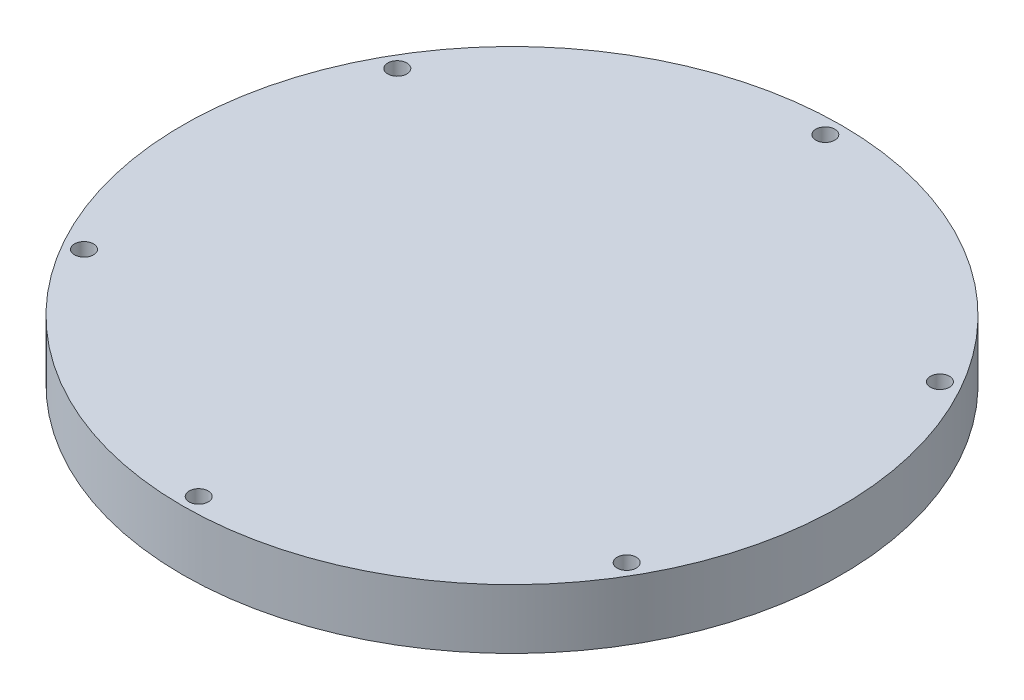
ISO-10303-21;
HEADER;
FILE_DESCRIPTION(('STEP AP214'),'2;1');
FILE_NAME('part.step','',(''),(''),'','','');
FILE_SCHEMA(('AUTOMOTIVE_DESIGN { 1 0 10303 214 1 1 1 1 }'));
ENDSEC;
DATA;
#1=APPLICATION_CONTEXT('core data for automotive mechanical design processes');
#2=APPLICATION_PROTOCOL_DEFINITION('international standard','automotive_design',2000,#1);
#3=PRODUCT_CONTEXT('',#1,'mechanical');
#4=PRODUCT('Part','Part','',(#3));
#5=PRODUCT_RELATED_PRODUCT_CATEGORY('part','',(#4));
#6=PRODUCT_DEFINITION_FORMATION('','',#4);
#7=PRODUCT_DEFINITION_CONTEXT('part definition',#1,'design');
#8=PRODUCT_DEFINITION('design','',#6,#7);
#9=PRODUCT_DEFINITION_SHAPE('','',#8);
#10=(LENGTH_UNIT() NAMED_UNIT(*) SI_UNIT(.MILLI.,.METRE.));
#11=(NAMED_UNIT(*) PLANE_ANGLE_UNIT() SI_UNIT($,.RADIAN.));
#12=(NAMED_UNIT(*) SI_UNIT($,.STERADIAN.) SOLID_ANGLE_UNIT());
#13=UNCERTAINTY_MEASURE_WITH_UNIT(LENGTH_MEASURE(1.E-05),#10,'distance_accuracy_value','');
#14=(GEOMETRIC_REPRESENTATION_CONTEXT(3) GLOBAL_UNCERTAINTY_ASSIGNED_CONTEXT((#13)) GLOBAL_UNIT_ASSIGNED_CONTEXT((#10,
#11,#12)) REPRESENTATION_CONTEXT('',''));
#15=CARTESIAN_POINT('',(0.,0.,0.));
#16=DIRECTION('',(0.,0.,1.));
#17=DIRECTION('',(1.,0.,0.));
#18=AXIS2_PLACEMENT_3D('',#15,#16,#17);
#19=CARTESIAN_POINT('',(0.,10.,0.));
#20=DIRECTION('',(0.,-1.,0.));
#21=DIRECTION('',(0.,0.,-1.));
#22=AXIS2_PLACEMENT_3D('',#19,#20,#21);
#23=CYLINDRICAL_SURFACE('',#22,55.25);
#24=CARTESIAN_POINT('',(0.,10.,0.));
#25=DIRECTION('',(0.,1.,0.));
#26=DIRECTION('',(0.,0.,1.));
#27=AXIS2_PLACEMENT_3D('',#24,#25,#26);
#28=CIRCLE('',#27,55.25);
#29=CARTESIAN_POINT('',(0.,10.,55.25));
#30=VERTEX_POINT('',#29);
#31=EDGE_CURVE('E10',#30,#30,#28,.T.);
#32=ORIENTED_EDGE('',*,*,#31,.F.);
#33=EDGE_LOOP('',(#32));
#34=FACE_BOUND('',#33,.T.);
#35=CARTESIAN_POINT('',(0.,0.,0.));
#36=DIRECTION('',(0.,1.,0.));
#37=DIRECTION('',(0.,0.,1.));
#38=AXIS2_PLACEMENT_3D('',#35,#36,#37);
#39=CIRCLE('',#38,55.25);
#40=CARTESIAN_POINT('',(0.,0.,55.25));
#41=VERTEX_POINT('',#40);
#42=EDGE_CURVE('E34',#41,#41,#39,.T.);
#43=ORIENTED_EDGE('',*,*,#42,.T.);
#44=EDGE_LOOP('',(#43));
#45=FACE_BOUND('',#44,.T.);
#46=ADVANCED_FACE('F31',(#34,#45),#23,.T.);
#47=CARTESIAN_POINT('',(0.,10.,0.));
#48=DIRECTION('',(0.,1.,0.));
#49=DIRECTION('',(0.,0.,1.));
#50=AXIS2_PLACEMENT_3D('',#47,#48,#49);
#51=PLANE('',#50);
#52=CARTESIAN_POINT('',(0.,10.,-52.525));
#53=DIRECTION('',(0.,1.,0.));
#54=DIRECTION('',(0.,0.,1.));
#55=AXIS2_PLACEMENT_3D('',#52,#53,#54);
#56=CIRCLE('',#55,1.59999999999999);
#57=CARTESIAN_POINT('',(0.,10.,-50.925));
#58=VERTEX_POINT('',#57);
#59=EDGE_CURVE('E75',#58,#58,#56,.T.);
#60=ORIENTED_EDGE('',*,*,#59,.F.);
#61=EDGE_LOOP('',(#60));
#62=FACE_BOUND('',#61,.T.);
#63=CARTESIAN_POINT('',(-45.4879843337758,10.,-26.2624999999967));
#64=DIRECTION('',(0.,1.,0.));
#65=DIRECTION('',(0.,0.,1.));
#66=AXIS2_PLACEMENT_3D('',#63,#64,#65);
#67=CIRCLE('',#66,1.59999999999999);
#68=CARTESIAN_POINT('',(-45.4879843337758,10.,-24.6624999999967));
#69=VERTEX_POINT('',#68);
#70=EDGE_CURVE('E69',#69,#69,#67,.T.);
#71=ORIENTED_EDGE('',*,*,#70,.F.);
#72=EDGE_LOOP('',(#71));
#73=FACE_BOUND('',#72,.T.);
#74=CARTESIAN_POINT('',(-45.487984333772,10.,26.2625000000032));
#75=DIRECTION('',(0.,1.,0.));
#76=DIRECTION('',(0.,0.,1.));
#77=AXIS2_PLACEMENT_3D('',#74,#75,#76);
#78=CIRCLE('',#77,1.59999999999999);
#79=CARTESIAN_POINT('',(-45.487984333772,10.,27.8625000000032));
#80=VERTEX_POINT('',#79);
#81=EDGE_CURVE('E63',#80,#80,#78,.T.);
#82=ORIENTED_EDGE('',*,*,#81,.F.);
#83=EDGE_LOOP('',(#82));
#84=FACE_BOUND('',#83,.T.);
#85=CARTESIAN_POINT('',(7.45138652453481E-12,10.,52.525));
#86=DIRECTION('',(0.,1.,0.));
#87=DIRECTION('',(0.,0.,1.));
#88=AXIS2_PLACEMENT_3D('',#85,#86,#87);
#89=CIRCLE('',#88,1.59999999999999);
#90=CARTESIAN_POINT('',(7.45138652453481E-12,10.,54.125));
#91=VERTEX_POINT('',#90);
#92=EDGE_CURVE('E57',#91,#91,#89,.T.);
#93=ORIENTED_EDGE('',*,*,#92,.F.);
#94=EDGE_LOOP('',(#93));
#95=FACE_BOUND('',#94,.T.);
#96=CARTESIAN_POINT('',(45.4879843337832,10.,26.2624999999968));
#97=DIRECTION('',(0.,1.,0.));
#98=DIRECTION('',(0.,0.,1.));
#99=AXIS2_PLACEMENT_3D('',#96,#97,#98);
#100=CIRCLE('',#99,1.59999999999999);
#101=CARTESIAN_POINT('',(45.4879843337832,10.,27.8624999999968));
#102=VERTEX_POINT('',#101);
#103=EDGE_CURVE('E51',#102,#102,#100,.T.);
#104=ORIENTED_EDGE('',*,*,#103,.F.);
#105=EDGE_LOOP('',(#104));
#106=FACE_BOUND('',#105,.T.);
#107=CARTESIAN_POINT('',(45.4879843337795,10.,-26.2625000000032));
#108=DIRECTION('',(0.,1.,0.));
#109=DIRECTION('',(0.,0.,1.));
#110=AXIS2_PLACEMENT_3D('',#107,#108,#109);
#111=CIRCLE('',#110,1.59999999999999);
#112=CARTESIAN_POINT('',(45.4879843337795,10.,-24.6625000000032));
#113=VERTEX_POINT('',#112);
#114=EDGE_CURVE('E45',#113,#113,#111,.T.);
#115=ORIENTED_EDGE('',*,*,#114,.F.);
#116=EDGE_LOOP('',(#115));
#117=FACE_BOUND('',#116,.T.);
#118=ORIENTED_EDGE('',*,*,#31,.T.);
#119=EDGE_LOOP('',(#118));
#120=FACE_BOUND('',#119,.T.);
#121=ADVANCED_FACE('F81',(#62,#73,#84,#95,#106,#117,#120),#51,.T.);
#122=CARTESIAN_POINT('',(0.,0.,0.));
#123=DIRECTION('',(0.,1.,0.));
#124=DIRECTION('',(0.,0.,1.));
#125=AXIS2_PLACEMENT_3D('',#122,#123,#124);
#126=PLANE('',#125);
#127=CARTESIAN_POINT('',(0.,0.,-52.525));
#128=DIRECTION('',(0.,1.,0.));
#129=DIRECTION('',(0.,0.,1.));
#130=AXIS2_PLACEMENT_3D('',#127,#128,#129);
#131=CIRCLE('',#130,1.6);
#132=CARTESIAN_POINT('',(0.,0.,-50.925));
#133=VERTEX_POINT('',#132);
#134=EDGE_CURVE('E72',#133,#133,#131,.T.);
#135=ORIENTED_EDGE('',*,*,#134,.T.);
#136=EDGE_LOOP('',(#135));
#137=FACE_BOUND('',#136,.T.);
#138=CARTESIAN_POINT('',(-45.4879843337758,0.,-26.2624999999967));
#139=DIRECTION('',(0.,1.,0.));
#140=DIRECTION('',(0.,0.,1.));
#141=AXIS2_PLACEMENT_3D('',#138,#139,#140);
#142=CIRCLE('',#141,1.6);
#143=CARTESIAN_POINT('',(-45.4879843337758,0.,-24.6624999999967));
#144=VERTEX_POINT('',#143);
#145=EDGE_CURVE('E66',#144,#144,#142,.T.);
#146=ORIENTED_EDGE('',*,*,#145,.T.);
#147=EDGE_LOOP('',(#146));
#148=FACE_BOUND('',#147,.T.);
#149=CARTESIAN_POINT('',(-45.487984333772,0.,26.2625000000032));
#150=DIRECTION('',(0.,1.,0.));
#151=DIRECTION('',(0.,0.,1.));
#152=AXIS2_PLACEMENT_3D('',#149,#150,#151);
#153=CIRCLE('',#152,1.6);
#154=CARTESIAN_POINT('',(-45.487984333772,0.,27.8625000000032));
#155=VERTEX_POINT('',#154);
#156=EDGE_CURVE('E60',#155,#155,#153,.T.);
#157=ORIENTED_EDGE('',*,*,#156,.T.);
#158=EDGE_LOOP('',(#157));
#159=FACE_BOUND('',#158,.T.);
#160=CARTESIAN_POINT('',(7.45138652453481E-12,0.,52.525));
#161=DIRECTION('',(0.,1.,0.));
#162=DIRECTION('',(0.,0.,1.));
#163=AXIS2_PLACEMENT_3D('',#160,#161,#162);
#164=CIRCLE('',#163,1.6);
#165=CARTESIAN_POINT('',(7.45138652453481E-12,0.,54.125));
#166=VERTEX_POINT('',#165);
#167=EDGE_CURVE('E54',#166,#166,#164,.T.);
#168=ORIENTED_EDGE('',*,*,#167,.T.);
#169=EDGE_LOOP('',(#168));
#170=FACE_BOUND('',#169,.T.);
#171=CARTESIAN_POINT('',(45.4879843337832,0.,26.2624999999968));
#172=DIRECTION('',(0.,1.,0.));
#173=DIRECTION('',(0.,0.,1.));
#174=AXIS2_PLACEMENT_3D('',#171,#172,#173);
#175=CIRCLE('',#174,1.6);
#176=CARTESIAN_POINT('',(45.4879843337832,0.,27.8624999999968));
#177=VERTEX_POINT('',#176);
#178=EDGE_CURVE('E48',#177,#177,#175,.T.);
#179=ORIENTED_EDGE('',*,*,#178,.T.);
#180=EDGE_LOOP('',(#179));
#181=FACE_BOUND('',#180,.T.);
#182=CARTESIAN_POINT('',(45.4879843337795,0.,-26.2625000000032));
#183=DIRECTION('',(0.,1.,0.));
#184=DIRECTION('',(0.,0.,1.));
#185=AXIS2_PLACEMENT_3D('',#182,#183,#184);
#186=CIRCLE('',#185,1.6);
#187=CARTESIAN_POINT('',(45.4879843337795,0.,-24.6625000000032));
#188=VERTEX_POINT('',#187);
#189=EDGE_CURVE('E41',#188,#188,#186,.T.);
#190=ORIENTED_EDGE('',*,*,#189,.T.);
#191=EDGE_LOOP('',(#190));
#192=FACE_BOUND('',#191,.T.);
#193=ORIENTED_EDGE('',*,*,#42,.F.);
#194=EDGE_LOOP('',(#193));
#195=FACE_BOUND('',#194,.T.);
#196=ADVANCED_FACE('F84',(#137,#148,#159,#170,#181,#192,#195),#126,.F.);
#197=CARTESIAN_POINT('',(45.4879843337795,10.,-26.2625000000032));
#198=DIRECTION('',(0.,1.,0.));
#199=DIRECTION('',(0.,0.,1.));
#200=AXIS2_PLACEMENT_3D('',#197,#198,#199);
#201=CYLINDRICAL_SURFACE('',#200,1.59999999999999);
#202=ORIENTED_EDGE('',*,*,#189,.F.);
#203=EDGE_LOOP('',(#202));
#204=FACE_BOUND('',#203,.T.);
#205=ORIENTED_EDGE('',*,*,#114,.T.);
#206=EDGE_LOOP('',(#205));
#207=FACE_BOUND('',#206,.T.);
#208=ADVANCED_FACE('F96',(#204,#207),#201,.F.);
#209=CARTESIAN_POINT('',(45.4879843337832,10.,26.2624999999968));
#210=DIRECTION('',(0.,1.,0.));
#211=DIRECTION('',(0.,0.,1.));
#212=AXIS2_PLACEMENT_3D('',#209,#210,#211);
#213=CYLINDRICAL_SURFACE('',#212,1.59999999999999);
#214=ORIENTED_EDGE('',*,*,#178,.F.);
#215=EDGE_LOOP('',(#214));
#216=FACE_BOUND('',#215,.T.);
#217=ORIENTED_EDGE('',*,*,#103,.T.);
#218=EDGE_LOOP('',(#217));
#219=FACE_BOUND('',#218,.T.);
#220=ADVANCED_FACE('F98',(#216,#219),#213,.F.);
#221=CARTESIAN_POINT('',(7.45138652453481E-12,10.,52.525));
#222=DIRECTION('',(0.,1.,0.));
#223=DIRECTION('',(0.,0.,1.));
#224=AXIS2_PLACEMENT_3D('',#221,#222,#223);
#225=CYLINDRICAL_SURFACE('',#224,1.59999999999999);
#226=ORIENTED_EDGE('',*,*,#167,.F.);
#227=EDGE_LOOP('',(#226));
#228=FACE_BOUND('',#227,.T.);
#229=ORIENTED_EDGE('',*,*,#92,.T.);
#230=EDGE_LOOP('',(#229));
#231=FACE_BOUND('',#230,.T.);
#232=ADVANCED_FACE('F105',(#228,#231),#225,.F.);
#233=CARTESIAN_POINT('',(-45.487984333772,10.,26.2625000000032));
#234=DIRECTION('',(0.,1.,0.));
#235=DIRECTION('',(0.,0.,1.));
#236=AXIS2_PLACEMENT_3D('',#233,#234,#235);
#237=CYLINDRICAL_SURFACE('',#236,1.59999999999999);
#238=ORIENTED_EDGE('',*,*,#156,.F.);
#239=EDGE_LOOP('',(#238));
#240=FACE_BOUND('',#239,.T.);
#241=ORIENTED_EDGE('',*,*,#81,.T.);
#242=EDGE_LOOP('',(#241));
#243=FACE_BOUND('',#242,.T.);
#244=ADVANCED_FACE('F144',(#240,#243),#237,.F.);
#245=CARTESIAN_POINT('',(-45.4879843337758,10.,-26.2624999999967));
#246=DIRECTION('',(0.,1.,0.));
#247=DIRECTION('',(0.,0.,1.));
#248=AXIS2_PLACEMENT_3D('',#245,#246,#247);
#249=CYLINDRICAL_SURFACE('',#248,1.59999999999999);
#250=ORIENTED_EDGE('',*,*,#145,.F.);
#251=EDGE_LOOP('',(#250));
#252=FACE_BOUND('',#251,.T.);
#253=ORIENTED_EDGE('',*,*,#70,.T.);
#254=EDGE_LOOP('',(#253));
#255=FACE_BOUND('',#254,.T.);
#256=ADVANCED_FACE('F154',(#252,#255),#249,.F.);
#257=CARTESIAN_POINT('',(0.,10.,-52.525));
#258=DIRECTION('',(0.,1.,0.));
#259=DIRECTION('',(0.,0.,1.));
#260=AXIS2_PLACEMENT_3D('',#257,#258,#259);
#261=CYLINDRICAL_SURFACE('',#260,1.59999999999999);
#262=ORIENTED_EDGE('',*,*,#134,.F.);
#263=EDGE_LOOP('',(#262));
#264=FACE_BOUND('',#263,.T.);
#265=ORIENTED_EDGE('',*,*,#59,.T.);
#266=EDGE_LOOP('',(#265));
#267=FACE_BOUND('',#266,.T.);
#268=ADVANCED_FACE('F79',(#264,#267),#261,.F.);
#269=CLOSED_SHELL('',(#46,#121,#196,#208,#220,#232,#244,#256,#268));
#270=MANIFOLD_SOLID_BREP('B2',#269);
#271=ADVANCED_BREP_SHAPE_REPRESENTATION('',(#18,#270),#14);
#272=SHAPE_DEFINITION_REPRESENTATION(#9,#271);
ENDSEC;
END-ISO-10303-21;
